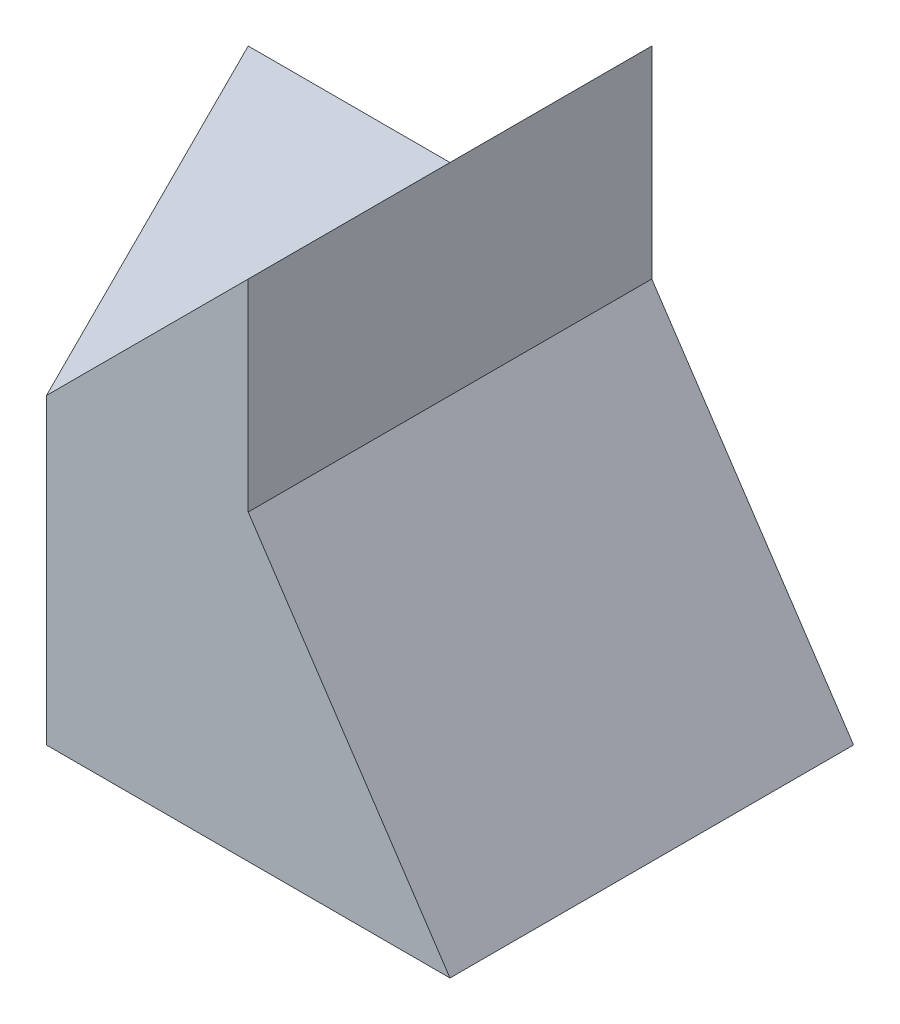
ISO-10303-21;
HEADER;
FILE_DESCRIPTION(('STEP AP214'),'2;1');
FILE_NAME('part.step','',(''),(''),'','','');
FILE_SCHEMA(('AUTOMOTIVE_DESIGN { 1 0 10303 214 1 1 1 1 }'));
ENDSEC;
DATA;
#1=APPLICATION_CONTEXT('core data for automotive mechanical design processes');
#2=APPLICATION_PROTOCOL_DEFINITION('international standard','automotive_design',2000,#1);
#3=PRODUCT_CONTEXT('',#1,'mechanical');
#4=PRODUCT('Part','Part','',(#3));
#5=PRODUCT_RELATED_PRODUCT_CATEGORY('part','',(#4));
#6=PRODUCT_DEFINITION_FORMATION('','',#4);
#7=PRODUCT_DEFINITION_CONTEXT('part definition',#1,'design');
#8=PRODUCT_DEFINITION('design','',#6,#7);
#9=PRODUCT_DEFINITION_SHAPE('','',#8);
#10=(LENGTH_UNIT() NAMED_UNIT(*) SI_UNIT(.MILLI.,.METRE.));
#11=(NAMED_UNIT(*) PLANE_ANGLE_UNIT() SI_UNIT($,.RADIAN.));
#12=(NAMED_UNIT(*) SI_UNIT($,.STERADIAN.) SOLID_ANGLE_UNIT());
#13=UNCERTAINTY_MEASURE_WITH_UNIT(LENGTH_MEASURE(1.E-05),#10,'distance_accuracy_value','');
#14=(GEOMETRIC_REPRESENTATION_CONTEXT(3) GLOBAL_UNCERTAINTY_ASSIGNED_CONTEXT((#13)) GLOBAL_UNIT_ASSIGNED_CONTEXT((#10,
#11,#12)) REPRESENTATION_CONTEXT('',''));
#15=CARTESIAN_POINT('',(0.,0.,0.));
#16=DIRECTION('',(0.,0.,1.));
#17=DIRECTION('',(1.,0.,0.));
#18=AXIS2_PLACEMENT_3D('',#15,#16,#17);
#19=CARTESIAN_POINT('',(-2.,3.,-4.));
#20=DIRECTION('',(0.,0.,1.));
#21=DIRECTION('',(1.,0.,0.));
#22=AXIS2_PLACEMENT_3D('',#19,#20,#21);
#23=PLANE('',#22);
#24=DIRECTION('',(-1.,0.,0.));
#25=VECTOR('',#24,1.);
#26=CARTESIAN_POINT('',(-2.,0.,-4.));
#27=LINE('',#26,#25);
#28=CARTESIAN_POINT('',(4.,0.,-4.));
#29=VERTEX_POINT('',#28);
#30=CARTESIAN_POINT('',(-2.,0.,-4.));
#31=VERTEX_POINT('',#30);
#32=EDGE_CURVE('E118',#29,#31,#27,.T.);
#33=ORIENTED_EDGE('',*,*,#32,.T.);
#34=DIRECTION('',(0.,-1.,0.));
#35=VECTOR('',#34,1.);
#36=CARTESIAN_POINT('',(-2.,3.,-4.));
#37=LINE('',#36,#35);
#38=CARTESIAN_POINT('',(-2.,3.,-4.));
#39=VERTEX_POINT('',#38);
#40=EDGE_CURVE('E11',#39,#31,#37,.T.);
#41=ORIENTED_EDGE('',*,*,#40,.F.);
#42=DIRECTION('',(-1.,0.,0.));
#43=VECTOR('',#42,1.);
#44=CARTESIAN_POINT('',(-2.,3.,-4.));
#45=LINE('',#44,#43);
#46=CARTESIAN_POINT('',(0.,3.,-4.));
#47=VERTEX_POINT('',#46);
#48=EDGE_CURVE('E121',#47,#39,#45,.T.);
#49=ORIENTED_EDGE('',*,*,#48,.F.);
#50=DIRECTION('',(0.707106781186548,0.707106781186547,0.));
#51=VECTOR('',#50,1.);
#52=CARTESIAN_POINT('',(0.,3.,-4.));
#53=LINE('',#52,#51);
#54=CARTESIAN_POINT('',(2.,5.,-4.));
#55=VERTEX_POINT('',#54);
#56=EDGE_CURVE('E112',#47,#55,#53,.T.);
#57=ORIENTED_EDGE('',*,*,#56,.T.);
#58=DIRECTION('',(0.,-1.,0.));
#59=VECTOR('',#58,1.);
#60=CARTESIAN_POINT('',(2.,5.,-4.));
#61=LINE('',#60,#59);
#62=CARTESIAN_POINT('',(2.,3.,-4.));
#63=VERTEX_POINT('',#62);
#64=EDGE_CURVE('E83',#55,#63,#61,.T.);
#65=ORIENTED_EDGE('',*,*,#64,.T.);
#66=DIRECTION('',(0.554700196225229,-0.832050294337844,0.));
#67=VECTOR('',#66,1.);
#68=CARTESIAN_POINT('',(2.,3.,-4.));
#69=LINE('',#68,#67);
#70=EDGE_CURVE('E104',#63,#29,#69,.T.);
#71=ORIENTED_EDGE('',*,*,#70,.T.);
#72=EDGE_LOOP('',(#33,#41,#49,#57,#65,#71));
#73=FACE_BOUND('',#72,.T.);
#74=ADVANCED_FACE('F33',(#73),#23,.F.);
#75=CARTESIAN_POINT('',(0.,3.,0.));
#76=DIRECTION('',(0.894427190999916,0.,-0.447213595499958));
#77=DIRECTION('',(-0.447213595499958,0.,-0.894427190999916));
#78=AXIS2_PLACEMENT_3D('',#75,#76,#77);
#79=PLANE('',#78);
#80=DIRECTION('',(0.447213595499958,0.,0.894427190999916));
#81=VECTOR('',#80,1.);
#82=CARTESIAN_POINT('',(0.,0.,0.));
#83=LINE('',#82,#81);
#84=CARTESIAN_POINT('',(0.,0.,0.));
#85=VERTEX_POINT('',#84);
#86=EDGE_CURVE('E122',#31,#85,#83,.T.);
#87=ORIENTED_EDGE('',*,*,#86,.T.);
#88=DIRECTION('',(0.,-1.,0.));
#89=VECTOR('',#88,1.);
#90=CARTESIAN_POINT('',(0.,3.,0.));
#91=LINE('',#90,#89);
#92=CARTESIAN_POINT('',(0.,3.,0.));
#93=VERTEX_POINT('',#92);
#94=EDGE_CURVE('E41',#93,#85,#91,.T.);
#95=ORIENTED_EDGE('',*,*,#94,.F.);
#96=DIRECTION('',(0.447213595499958,0.,0.894427190999916));
#97=VECTOR('',#96,1.);
#98=CARTESIAN_POINT('',(0.,3.,0.));
#99=LINE('',#98,#97);
#100=EDGE_CURVE('E48',#39,#93,#99,.T.);
#101=ORIENTED_EDGE('',*,*,#100,.F.);
#102=ORIENTED_EDGE('',*,*,#40,.T.);
#103=EDGE_LOOP('',(#87,#95,#101,#102));
#104=FACE_BOUND('',#103,.T.);
#105=ADVANCED_FACE('F138',(#104),#79,.F.);
#106=CARTESIAN_POINT('',(0.,3.,0.));
#107=DIRECTION('',(0.,1.,0.));
#108=DIRECTION('',(0.,0.,1.));
#109=AXIS2_PLACEMENT_3D('',#106,#107,#108);
#110=PLANE('',#109);
#111=DIRECTION('',(0.,0.,-1.));
#112=VECTOR('',#111,1.);
#113=CARTESIAN_POINT('',(0.,3.,-4.));
#114=LINE('',#113,#112);
#115=EDGE_CURVE('E103',#93,#47,#114,.T.);
#116=ORIENTED_EDGE('',*,*,#115,.T.);
#117=ORIENTED_EDGE('',*,*,#48,.T.);
#118=ORIENTED_EDGE('',*,*,#100,.T.);
#119=EDGE_LOOP('',(#116,#117,#118));
#120=FACE_BOUND('',#119,.T.);
#121=ADVANCED_FACE('F136',(#120),#110,.T.);
#122=CARTESIAN_POINT('',(0.,0.,0.));
#123=DIRECTION('',(0.,1.,0.));
#124=DIRECTION('',(0.,0.,1.));
#125=AXIS2_PLACEMENT_3D('',#122,#123,#124);
#126=PLANE('',#125);
#127=ORIENTED_EDGE('',*,*,#32,.F.);
#128=DIRECTION('',(0.,0.,-1.));
#129=VECTOR('',#128,1.);
#130=CARTESIAN_POINT('',(4.,0.,0.));
#131=LINE('',#130,#129);
#132=CARTESIAN_POINT('',(4.,0.,0.));
#133=VERTEX_POINT('',#132);
#134=EDGE_CURVE('E115',#133,#29,#131,.T.);
#135=ORIENTED_EDGE('',*,*,#134,.F.);
#136=DIRECTION('',(-1.,0.,0.));
#137=VECTOR('',#136,1.);
#138=CARTESIAN_POINT('',(4.,0.,0.));
#139=LINE('',#138,#137);
#140=EDGE_CURVE('E89',#133,#85,#139,.T.);
#141=ORIENTED_EDGE('',*,*,#140,.T.);
#142=ORIENTED_EDGE('',*,*,#86,.F.);
#143=EDGE_LOOP('',(#127,#135,#141,#142));
#144=FACE_BOUND('',#143,.T.);
#145=ADVANCED_FACE('F130',(#144),#126,.F.);
#146=CARTESIAN_POINT('',(2.,3.,0.));
#147=DIRECTION('',(0.832050294337844,0.554700196225229,0.));
#148=DIRECTION('',(-0.554700196225229,0.832050294337844,0.));
#149=AXIS2_PLACEMENT_3D('',#146,#147,#148);
#150=PLANE('',#149);
#151=ORIENTED_EDGE('',*,*,#70,.F.);
#152=DIRECTION('',(0.,0.,-1.));
#153=VECTOR('',#152,1.);
#154=CARTESIAN_POINT('',(2.,3.,0.));
#155=LINE('',#154,#153);
#156=CARTESIAN_POINT('',(2.,3.,0.));
#157=VERTEX_POINT('',#156);
#158=EDGE_CURVE('E88',#157,#63,#155,.T.);
#159=ORIENTED_EDGE('',*,*,#158,.F.);
#160=DIRECTION('',(0.554700196225229,-0.832050294337844,0.));
#161=VECTOR('',#160,1.);
#162=CARTESIAN_POINT('',(2.,3.,0.));
#163=LINE('',#162,#161);
#164=EDGE_CURVE('E99',#157,#133,#163,.T.);
#165=ORIENTED_EDGE('',*,*,#164,.T.);
#166=ORIENTED_EDGE('',*,*,#134,.T.);
#167=EDGE_LOOP('',(#151,#159,#165,#166));
#168=FACE_BOUND('',#167,.T.);
#169=ADVANCED_FACE('F133',(#168),#150,.T.);
#170=CARTESIAN_POINT('',(2.,5.,0.));
#171=DIRECTION('',(1.,0.,0.));
#172=DIRECTION('',(0.,1.,0.));
#173=AXIS2_PLACEMENT_3D('',#170,#171,#172);
#174=PLANE('',#173);
#175=ORIENTED_EDGE('',*,*,#64,.F.);
#176=DIRECTION('',(0.,0.,-1.));
#177=VECTOR('',#176,1.);
#178=CARTESIAN_POINT('',(2.,5.,0.));
#179=LINE('',#178,#177);
#180=CARTESIAN_POINT('',(2.,5.,0.));
#181=VERTEX_POINT('',#180);
#182=EDGE_CURVE('E78',#181,#55,#179,.T.);
#183=ORIENTED_EDGE('',*,*,#182,.F.);
#184=DIRECTION('',(0.,-1.,0.));
#185=VECTOR('',#184,1.);
#186=CARTESIAN_POINT('',(2.,5.,0.));
#187=LINE('',#186,#185);
#188=EDGE_CURVE('E81',#181,#157,#187,.T.);
#189=ORIENTED_EDGE('',*,*,#188,.T.);
#190=ORIENTED_EDGE('',*,*,#158,.T.);
#191=EDGE_LOOP('',(#175,#183,#189,#190));
#192=FACE_BOUND('',#191,.T.);
#193=ADVANCED_FACE('F80',(#192),#174,.T.);
#194=CARTESIAN_POINT('',(0.,3.,0.));
#195=DIRECTION('',(-0.707106781186547,0.707106781186548,0.));
#196=DIRECTION('',(-0.707106781186548,-0.707106781186547,0.));
#197=AXIS2_PLACEMENT_3D('',#194,#195,#196);
#198=PLANE('',#197);
#199=ORIENTED_EDGE('',*,*,#56,.F.);
#200=ORIENTED_EDGE('',*,*,#115,.F.);
#201=DIRECTION('',(0.707106781186548,0.707106781186547,0.));
#202=VECTOR('',#201,1.);
#203=CARTESIAN_POINT('',(0.,3.,0.));
#204=LINE('',#203,#202);
#205=EDGE_CURVE('E96',#93,#181,#204,.T.);
#206=ORIENTED_EDGE('',*,*,#205,.T.);
#207=ORIENTED_EDGE('',*,*,#182,.T.);
#208=EDGE_LOOP('',(#199,#200,#206,#207));
#209=FACE_BOUND('',#208,.T.);
#210=ADVANCED_FACE('F102',(#209),#198,.T.);
#211=CARTESIAN_POINT('',(0.,0.,0.));
#212=DIRECTION('',(0.,0.,1.));
#213=DIRECTION('',(1.,0.,0.));
#214=AXIS2_PLACEMENT_3D('',#211,#212,#213);
#215=PLANE('',#214);
#216=ORIENTED_EDGE('',*,*,#94,.T.);
#217=ORIENTED_EDGE('',*,*,#140,.F.);
#218=ORIENTED_EDGE('',*,*,#164,.F.);
#219=ORIENTED_EDGE('',*,*,#188,.F.);
#220=ORIENTED_EDGE('',*,*,#205,.F.);
#221=EDGE_LOOP('',(#216,#217,#218,#219,#220));
#222=FACE_BOUND('',#221,.T.);
#223=ADVANCED_FACE('F95',(#222),#215,.T.);
#224=CLOSED_SHELL('',(#74,#105,#121,#145,#169,#193,#210,#223));
#225=MANIFOLD_SOLID_BREP('B2',#224);
#226=ADVANCED_BREP_SHAPE_REPRESENTATION('',(#18,#225),#14);
#227=SHAPE_DEFINITION_REPRESENTATION(#9,#226);
ENDSEC;
END-ISO-10303-21;
